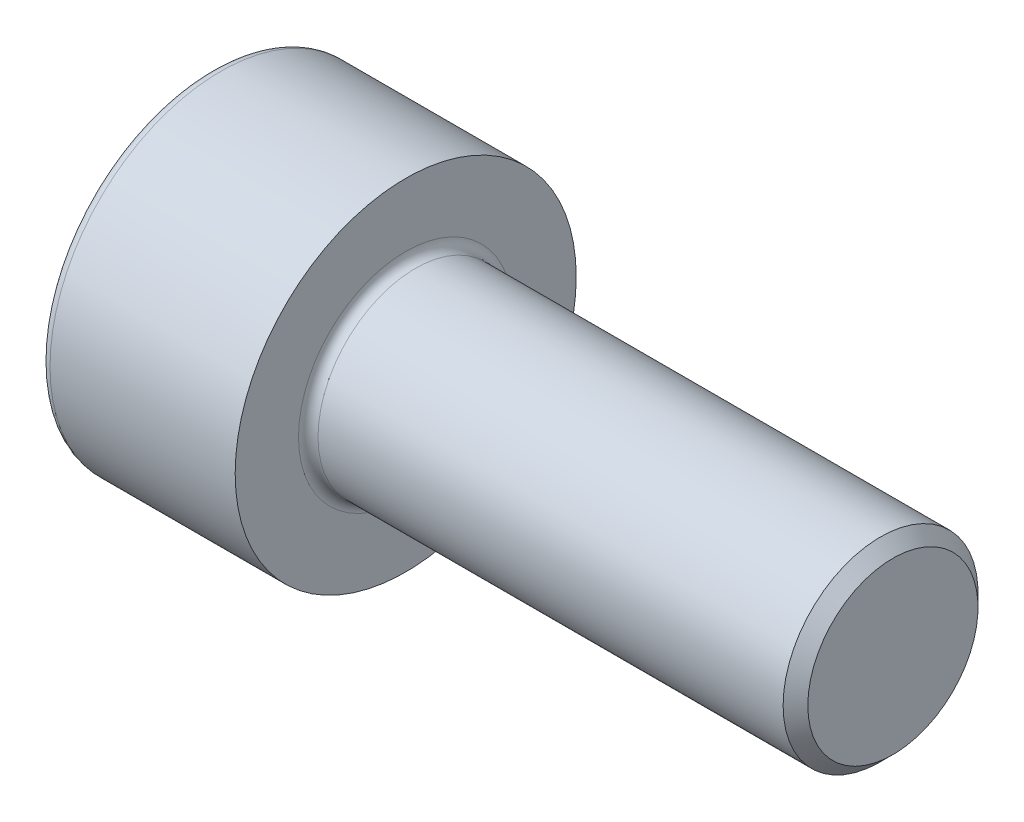
ISO-10303-21;
HEADER;
FILE_DESCRIPTION(('STEP AP214'),'2;1');
FILE_NAME('part.step','',(''),(''),'','','');
FILE_SCHEMA(('AUTOMOTIVE_DESIGN { 1 0 10303 214 1 1 1 1 }'));
ENDSEC;
DATA;
#1=APPLICATION_CONTEXT('core data for automotive mechanical design processes');
#2=APPLICATION_PROTOCOL_DEFINITION('international standard','automotive_design',2000,#1);
#3=PRODUCT_CONTEXT('',#1,'mechanical');
#4=PRODUCT('Part','Part','',(#3));
#5=PRODUCT_RELATED_PRODUCT_CATEGORY('part','',(#4));
#6=PRODUCT_DEFINITION_FORMATION('','',#4);
#7=PRODUCT_DEFINITION_CONTEXT('part definition',#1,'design');
#8=PRODUCT_DEFINITION('design','',#6,#7);
#9=PRODUCT_DEFINITION_SHAPE('','',#8);
#10=(LENGTH_UNIT() NAMED_UNIT(*) SI_UNIT(.MILLI.,.METRE.));
#11=(NAMED_UNIT(*) PLANE_ANGLE_UNIT() SI_UNIT($,.RADIAN.));
#12=(NAMED_UNIT(*) SI_UNIT($,.STERADIAN.) SOLID_ANGLE_UNIT());
#13=UNCERTAINTY_MEASURE_WITH_UNIT(LENGTH_MEASURE(1.E-05),#10,'distance_accuracy_value','');
#14=(GEOMETRIC_REPRESENTATION_CONTEXT(3) GLOBAL_UNCERTAINTY_ASSIGNED_CONTEXT((#13)) GLOBAL_UNIT_ASSIGNED_CONTEXT((#10,
#11,#12)) REPRESENTATION_CONTEXT('',''));
#15=CARTESIAN_POINT('',(0.,0.,0.));
#16=DIRECTION('',(0.,0.,1.));
#17=DIRECTION('',(1.,0.,0.));
#18=AXIS2_PLACEMENT_3D('',#15,#16,#17);
#19=CARTESIAN_POINT('',(10.,0.,0.));
#20=DIRECTION('',(-1.,0.,0.));
#21=DIRECTION('',(0.,0.,1.));
#22=AXIS2_PLACEMENT_3D('',#19,#20,#21);
#23=CONICAL_SURFACE('',#22,1.7464999999935,0.785398163397448);
#24=CARTESIAN_POINT('',(9.7464999999935,0.,0.));
#25=DIRECTION('',(-1.,0.,0.));
#26=DIRECTION('',(0.,0.,1.));
#27=AXIS2_PLACEMENT_3D('',#24,#25,#26);
#28=CIRCLE('',#27,2.);
#29=CARTESIAN_POINT('',(9.7464999999935,0.,2.));
#30=VERTEX_POINT('',#29);
#31=EDGE_CURVE('E11',#30,#30,#28,.T.);
#32=ORIENTED_EDGE('',*,*,#31,.F.);
#33=EDGE_LOOP('',(#32));
#34=FACE_BOUND('',#33,.T.);
#35=CARTESIAN_POINT('',(10.,0.,0.));
#36=DIRECTION('',(-1.,0.,0.));
#37=DIRECTION('',(0.,0.,1.));
#38=AXIS2_PLACEMENT_3D('',#35,#36,#37);
#39=CIRCLE('',#38,1.7464999999935);
#40=CARTESIAN_POINT('',(10.,0.,1.7464999999935));
#41=VERTEX_POINT('',#40);
#42=EDGE_CURVE('E133',#41,#41,#39,.T.);
#43=ORIENTED_EDGE('',*,*,#42,.T.);
#44=EDGE_LOOP('',(#43));
#45=FACE_BOUND('',#44,.T.);
#46=ADVANCED_FACE('F32',(#34,#45),#23,.T.);
#47=CARTESIAN_POINT('',(-4.,0.,0.));
#48=DIRECTION('',(-1.,0.,0.));
#49=DIRECTION('',(0.,0.,1.));
#50=AXIS2_PLACEMENT_3D('',#47,#48,#49);
#51=CYLINDRICAL_SURFACE('',#50,2.);
#52=CARTESIAN_POINT('',(0.200000000000001,0.,0.));
#53=DIRECTION('',(-1.,0.,0.));
#54=DIRECTION('',(0.,0.,1.));
#55=AXIS2_PLACEMENT_3D('',#52,#53,#54);
#56=CIRCLE('',#55,2.);
#57=CARTESIAN_POINT('',(0.200000000000001,0.,2.));
#58=VERTEX_POINT('',#57);
#59=EDGE_CURVE('E39',#58,#58,#56,.T.);
#60=ORIENTED_EDGE('',*,*,#59,.F.);
#61=EDGE_LOOP('',(#60));
#62=FACE_BOUND('',#61,.T.);
#63=ORIENTED_EDGE('',*,*,#31,.T.);
#64=EDGE_LOOP('',(#63));
#65=FACE_BOUND('',#64,.T.);
#66=ADVANCED_FACE('F157',(#62,#65),#51,.T.);
#67=CARTESIAN_POINT('',(0.2,0.,0.));
#68=DIRECTION('',(-1.,0.,0.));
#69=DIRECTION('',(0.,0.,1.));
#70=AXIS2_PLACEMENT_3D('',#67,#68,#69);
#71=TOROIDAL_SURFACE('',#70,2.2,0.2);
#72=CARTESIAN_POINT('',(0.,0.,0.));
#73=DIRECTION('',(-1.,0.,0.));
#74=DIRECTION('',(0.,0.,1.));
#75=AXIS2_PLACEMENT_3D('',#72,#73,#74);
#76=CIRCLE('',#75,2.2);
#77=CARTESIAN_POINT('',(0.,0.,2.2));
#78=VERTEX_POINT('',#77);
#79=EDGE_CURVE('E150',#78,#78,#76,.T.);
#80=ORIENTED_EDGE('',*,*,#79,.F.);
#81=EDGE_LOOP('',(#80));
#82=FACE_BOUND('',#81,.T.);
#83=ORIENTED_EDGE('',*,*,#59,.T.);
#84=EDGE_LOOP('',(#83));
#85=FACE_BOUND('',#84,.T.);
#86=ADVANCED_FACE('F155',(#82,#85),#71,.F.);
#87=CARTESIAN_POINT('',(0.,2.2,0.));
#88=DIRECTION('',(-1.,0.,0.));
#89=DIRECTION('',(0.,0.,1.));
#90=AXIS2_PLACEMENT_3D('',#87,#88,#89);
#91=PLANE('',#90);
#92=CARTESIAN_POINT('',(0.,0.,0.));
#93=DIRECTION('',(-1.,0.,0.));
#94=DIRECTION('',(0.,0.,1.));
#95=AXIS2_PLACEMENT_3D('',#92,#93,#94);
#96=CIRCLE('',#95,3.5);
#97=CARTESIAN_POINT('',(0.,0.,3.5));
#98=VERTEX_POINT('',#97);
#99=EDGE_CURVE('E147',#98,#98,#96,.T.);
#100=ORIENTED_EDGE('',*,*,#99,.F.);
#101=EDGE_LOOP('',(#100));
#102=FACE_BOUND('',#101,.T.);
#103=ORIENTED_EDGE('',*,*,#79,.T.);
#104=EDGE_LOOP('',(#103));
#105=FACE_BOUND('',#104,.T.);
#106=ADVANCED_FACE('F188',(#102,#105),#91,.F.);
#107=CARTESIAN_POINT('',(-4.,0.,0.));
#108=DIRECTION('',(-1.,0.,0.));
#109=DIRECTION('',(0.,0.,1.));
#110=AXIS2_PLACEMENT_3D('',#107,#108,#109);
#111=CYLINDRICAL_SURFACE('',#110,3.5);
#112=CARTESIAN_POINT('',(-3.8,0.,0.));
#113=DIRECTION('',(-1.,0.,0.));
#114=DIRECTION('',(0.,0.,1.));
#115=AXIS2_PLACEMENT_3D('',#112,#113,#114);
#116=CIRCLE('',#115,3.5);
#117=CARTESIAN_POINT('',(-3.8,0.,3.5));
#118=VERTEX_POINT('',#117);
#119=EDGE_CURVE('E144',#118,#118,#116,.T.);
#120=ORIENTED_EDGE('',*,*,#119,.F.);
#121=EDGE_LOOP('',(#120));
#122=FACE_BOUND('',#121,.T.);
#123=ORIENTED_EDGE('',*,*,#99,.T.);
#124=EDGE_LOOP('',(#123));
#125=FACE_BOUND('',#124,.T.);
#126=ADVANCED_FACE('F184',(#122,#125),#111,.T.);
#127=CARTESIAN_POINT('',(-3.8,0.,0.));
#128=DIRECTION('',(-1.,0.,0.));
#129=DIRECTION('',(0.,0.,1.));
#130=AXIS2_PLACEMENT_3D('',#127,#128,#129);
#131=TOROIDAL_SURFACE('',#130,3.3,0.200000000000001);
#132=CARTESIAN_POINT('',(-4.,0.,0.));
#133=DIRECTION('',(-1.,0.,0.));
#134=DIRECTION('',(0.,0.,1.));
#135=AXIS2_PLACEMENT_3D('',#132,#133,#134);
#136=CIRCLE('',#135,3.3);
#137=CARTESIAN_POINT('',(-4.,0.,3.3));
#138=VERTEX_POINT('',#137);
#139=EDGE_CURVE('E141',#138,#138,#136,.T.);
#140=ORIENTED_EDGE('',*,*,#139,.F.);
#141=EDGE_LOOP('',(#140));
#142=FACE_BOUND('',#141,.T.);
#143=ORIENTED_EDGE('',*,*,#119,.T.);
#144=EDGE_LOOP('',(#143));
#145=FACE_BOUND('',#144,.T.);
#146=ADVANCED_FACE('F177',(#142,#145),#131,.T.);
#147=CARTESIAN_POINT('',(-4.,3.3,0.));
#148=DIRECTION('',(1.,0.,0.));
#149=DIRECTION('',(0.,0.,-1.));
#150=AXIS2_PLACEMENT_3D('',#147,#148,#149);
#151=PLANE('',#150);
#152=DIRECTION('',(0.,0.5,-0.866025403784438));
#153=VECTOR('',#152,1.);
#154=CARTESIAN_POINT('',(-4.,0.886232663206076,1.535));
#155=LINE('',#154,#153);
#156=CARTESIAN_POINT('',(-4.,0.886232663206076,1.535));
#157=VERTEX_POINT('',#156);
#158=CARTESIAN_POINT('',(-4.,1.77246532641215,0.));
#159=VERTEX_POINT('',#158);
#160=EDGE_CURVE('E120',#157,#159,#155,.T.);
#161=ORIENTED_EDGE('',*,*,#160,.F.);
#162=DIRECTION('',(0.,1.,0.));
#163=VECTOR('',#162,1.);
#164=CARTESIAN_POINT('',(-4.,-0.886232663206076,1.535));
#165=LINE('',#164,#163);
#166=CARTESIAN_POINT('',(-4.,-0.886232663206076,1.535));
#167=VERTEX_POINT('',#166);
#168=EDGE_CURVE('E46',#167,#157,#165,.T.);
#169=ORIENTED_EDGE('',*,*,#168,.F.);
#170=DIRECTION('',(0.,0.5,0.866025403784439));
#171=VECTOR('',#170,1.);
#172=CARTESIAN_POINT('',(-4.,-1.77246532641215,0.));
#173=LINE('',#172,#171);
#174=CARTESIAN_POINT('',(-4.,-1.77246532641215,0.));
#175=VERTEX_POINT('',#174);
#176=EDGE_CURVE('E129',#175,#167,#173,.T.);
#177=ORIENTED_EDGE('',*,*,#176,.F.);
#178=DIRECTION('',(0.,-0.5,0.866025403784439));
#179=VECTOR('',#178,1.);
#180=CARTESIAN_POINT('',(-4.,-0.886232663206076,-1.535));
#181=LINE('',#180,#179);
#182=CARTESIAN_POINT('',(-4.,-0.886232663206076,-1.535));
#183=VERTEX_POINT('',#182);
#184=EDGE_CURVE('E127',#183,#175,#181,.T.);
#185=ORIENTED_EDGE('',*,*,#184,.F.);
#186=DIRECTION('',(0.,-1.,0.));
#187=VECTOR('',#186,1.);
#188=CARTESIAN_POINT('',(-4.,0.886232663206076,-1.535));
#189=LINE('',#188,#187);
#190=CARTESIAN_POINT('',(-4.,0.886232663206076,-1.535));
#191=VERTEX_POINT('',#190);
#192=EDGE_CURVE('E94',#191,#183,#189,.T.);
#193=ORIENTED_EDGE('',*,*,#192,.F.);
#194=DIRECTION('',(0.,-0.5,-0.866025403784439));
#195=VECTOR('',#194,1.);
#196=CARTESIAN_POINT('',(-4.,1.77246532641215,0.));
#197=LINE('',#196,#195);
#198=EDGE_CURVE('E123',#159,#191,#197,.T.);
#199=ORIENTED_EDGE('',*,*,#198,.F.);
#200=EDGE_LOOP('',(#161,#169,#177,#185,#193,#199));
#201=FACE_BOUND('',#200,.T.);
#202=ORIENTED_EDGE('',*,*,#139,.T.);
#203=EDGE_LOOP('',(#202));
#204=FACE_BOUND('',#203,.T.);
#205=ADVANCED_FACE('F169',(#201,#204),#151,.F.);
#206=CARTESIAN_POINT('',(10.,1.7464999999935,0.));
#207=DIRECTION('',(-1.,0.,0.));
#208=DIRECTION('',(0.,0.,1.));
#209=AXIS2_PLACEMENT_3D('',#206,#207,#208);
#210=PLANE('',#209);
#211=ORIENTED_EDGE('',*,*,#42,.F.);
#212=EDGE_LOOP('',(#211));
#213=FACE_BOUND('',#212,.T.);
#214=ADVANCED_FACE('F166',(#213),#210,.F.);
#215=CARTESIAN_POINT('',(-2.,-0.886232663206076,1.535));
#216=DIRECTION('',(0.,0.,1.));
#217=DIRECTION('',(1.,0.,0.));
#218=AXIS2_PLACEMENT_3D('',#215,#216,#217);
#219=PLANE('',#218);
#220=ORIENTED_EDGE('',*,*,#168,.T.);
#221=DIRECTION('',(-1.,0.,0.));
#222=VECTOR('',#221,1.);
#223=CARTESIAN_POINT('',(-2.,0.886232663206076,1.535));
#224=LINE('',#223,#222);
#225=CARTESIAN_POINT('',(-2.,0.886232663206076,1.535));
#226=VERTEX_POINT('',#225);
#227=EDGE_CURVE('E76',#226,#157,#224,.T.);
#228=ORIENTED_EDGE('',*,*,#227,.F.);
#229=DIRECTION('',(0.,1.,0.));
#230=VECTOR('',#229,1.);
#231=CARTESIAN_POINT('',(-2.,-0.886232663206076,1.535));
#232=LINE('',#231,#230);
#233=CARTESIAN_POINT('',(-2.,-0.886232663206076,1.535));
#234=VERTEX_POINT('',#233);
#235=EDGE_CURVE('E131',#234,#226,#232,.T.);
#236=ORIENTED_EDGE('',*,*,#235,.F.);
#237=DIRECTION('',(-1.,0.,0.));
#238=VECTOR('',#237,1.);
#239=CARTESIAN_POINT('',(-2.,-0.886232663206076,1.535));
#240=LINE('',#239,#238);
#241=EDGE_CURVE('E54',#234,#167,#240,.T.);
#242=ORIENTED_EDGE('',*,*,#241,.T.);
#243=EDGE_LOOP('',(#220,#228,#236,#242));
#244=FACE_BOUND('',#243,.T.);
#245=ADVANCED_FACE('F168',(#244),#219,.F.);
#246=CARTESIAN_POINT('',(-2.,-1.77246532641215,0.));
#247=DIRECTION('',(0.,-0.866025403784439,0.5));
#248=DIRECTION('',(0.,-0.5,-0.866025403784439));
#249=AXIS2_PLACEMENT_3D('',#246,#247,#248);
#250=PLANE('',#249);
#251=ORIENTED_EDGE('',*,*,#176,.T.);
#252=ORIENTED_EDGE('',*,*,#241,.F.);
#253=DIRECTION('',(0.,0.5,0.866025403784439));
#254=VECTOR('',#253,1.);
#255=CARTESIAN_POINT('',(-2.,-1.77246532641215,0.));
#256=LINE('',#255,#254);
#257=CARTESIAN_POINT('',(-2.,-1.77246532641215,0.));
#258=VERTEX_POINT('',#257);
#259=EDGE_CURVE('E106',#258,#234,#256,.T.);
#260=ORIENTED_EDGE('',*,*,#259,.F.);
#261=DIRECTION('',(-1.,0.,0.));
#262=VECTOR('',#261,1.);
#263=CARTESIAN_POINT('',(-2.,-1.77246532641215,0.));
#264=LINE('',#263,#262);
#265=EDGE_CURVE('E98',#258,#175,#264,.T.);
#266=ORIENTED_EDGE('',*,*,#265,.T.);
#267=EDGE_LOOP('',(#251,#252,#260,#266));
#268=FACE_BOUND('',#267,.T.);
#269=ADVANCED_FACE('F175',(#268),#250,.F.);
#270=CARTESIAN_POINT('',(-2.,-0.886232663206076,-1.535));
#271=DIRECTION('',(0.,-0.866025403784439,-0.5));
#272=DIRECTION('',(0.,0.5,-0.866025403784439));
#273=AXIS2_PLACEMENT_3D('',#270,#271,#272);
#274=PLANE('',#273);
#275=ORIENTED_EDGE('',*,*,#184,.T.);
#276=ORIENTED_EDGE('',*,*,#265,.F.);
#277=DIRECTION('',(0.,-0.5,0.866025403784439));
#278=VECTOR('',#277,1.);
#279=CARTESIAN_POINT('',(-2.,-0.886232663206076,-1.535));
#280=LINE('',#279,#278);
#281=CARTESIAN_POINT('',(-2.,-0.886232663206076,-1.535));
#282=VERTEX_POINT('',#281);
#283=EDGE_CURVE('E102',#282,#258,#280,.T.);
#284=ORIENTED_EDGE('',*,*,#283,.F.);
#285=DIRECTION('',(-1.,0.,0.));
#286=VECTOR('',#285,1.);
#287=CARTESIAN_POINT('',(-2.,-0.886232663206076,-1.535));
#288=LINE('',#287,#286);
#289=EDGE_CURVE('E87',#282,#183,#288,.T.);
#290=ORIENTED_EDGE('',*,*,#289,.T.);
#291=EDGE_LOOP('',(#275,#276,#284,#290));
#292=FACE_BOUND('',#291,.T.);
#293=ADVANCED_FACE('F103',(#292),#274,.F.);
#294=CARTESIAN_POINT('',(-2.,0.886232663206076,-1.535));
#295=DIRECTION('',(0.,0.,-1.));
#296=DIRECTION('',(0.,1.,0.));
#297=AXIS2_PLACEMENT_3D('',#294,#295,#296);
#298=PLANE('',#297);
#299=ORIENTED_EDGE('',*,*,#192,.T.);
#300=ORIENTED_EDGE('',*,*,#289,.F.);
#301=DIRECTION('',(0.,-1.,0.));
#302=VECTOR('',#301,1.);
#303=CARTESIAN_POINT('',(-2.,0.886232663206076,-1.535));
#304=LINE('',#303,#302);
#305=CARTESIAN_POINT('',(-2.,0.886232663206076,-1.535));
#306=VERTEX_POINT('',#305);
#307=EDGE_CURVE('E91',#306,#282,#304,.T.);
#308=ORIENTED_EDGE('',*,*,#307,.F.);
#309=DIRECTION('',(-1.,0.,0.));
#310=VECTOR('',#309,1.);
#311=CARTESIAN_POINT('',(-2.,0.886232663206076,-1.535));
#312=LINE('',#311,#310);
#313=EDGE_CURVE('E99',#306,#191,#312,.T.);
#314=ORIENTED_EDGE('',*,*,#313,.T.);
#315=EDGE_LOOP('',(#299,#300,#308,#314));
#316=FACE_BOUND('',#315,.T.);
#317=ADVANCED_FACE('F89',(#316),#298,.F.);
#318=CARTESIAN_POINT('',(-2.,1.77246532641215,0.));
#319=DIRECTION('',(0.,0.866025403784439,-0.5));
#320=DIRECTION('',(0.,0.5,0.866025403784439));
#321=AXIS2_PLACEMENT_3D('',#318,#319,#320);
#322=PLANE('',#321);
#323=ORIENTED_EDGE('',*,*,#198,.T.);
#324=ORIENTED_EDGE('',*,*,#313,.F.);
#325=DIRECTION('',(0.,-0.5,-0.866025403784439));
#326=VECTOR('',#325,1.);
#327=CARTESIAN_POINT('',(-2.,1.77246532641215,0.));
#328=LINE('',#327,#326);
#329=CARTESIAN_POINT('',(-2.,1.77246532641215,0.));
#330=VERTEX_POINT('',#329);
#331=EDGE_CURVE('E112',#330,#306,#328,.T.);
#332=ORIENTED_EDGE('',*,*,#331,.F.);
#333=DIRECTION('',(-1.,0.,0.));
#334=VECTOR('',#333,1.);
#335=CARTESIAN_POINT('',(-2.,1.77246532641215,0.));
#336=LINE('',#335,#334);
#337=EDGE_CURVE('E136',#330,#159,#336,.T.);
#338=ORIENTED_EDGE('',*,*,#337,.T.);
#339=EDGE_LOOP('',(#323,#324,#332,#338));
#340=FACE_BOUND('',#339,.T.);
#341=ADVANCED_FACE('F250',(#340),#322,.F.);
#342=CARTESIAN_POINT('',(-2.,0.886232663206076,1.535));
#343=DIRECTION('',(0.,0.866025403784439,0.5));
#344=DIRECTION('',(0.,-0.5,0.866025403784438));
#345=AXIS2_PLACEMENT_3D('',#342,#343,#344);
#346=PLANE('',#345);
#347=ORIENTED_EDGE('',*,*,#160,.T.);
#348=ORIENTED_EDGE('',*,*,#337,.F.);
#349=DIRECTION('',(0.,0.5,-0.866025403784438));
#350=VECTOR('',#349,1.);
#351=CARTESIAN_POINT('',(-2.,0.886232663206076,1.535));
#352=LINE('',#351,#350);
#353=EDGE_CURVE('E114',#226,#330,#352,.T.);
#354=ORIENTED_EDGE('',*,*,#353,.F.);
#355=ORIENTED_EDGE('',*,*,#227,.T.);
#356=EDGE_LOOP('',(#347,#348,#354,#355));
#357=FACE_BOUND('',#356,.T.);
#358=ADVANCED_FACE('F259',(#357),#346,.F.);
#359=CARTESIAN_POINT('',(-2.,0.,0.));
#360=DIRECTION('',(-1.,0.,0.));
#361=DIRECTION('',(0.,0.,1.));
#362=AXIS2_PLACEMENT_3D('',#359,#360,#361);
#363=PLANE('',#362);
#364=ORIENTED_EDGE('',*,*,#235,.T.);
#365=ORIENTED_EDGE('',*,*,#353,.T.);
#366=ORIENTED_EDGE('',*,*,#331,.T.);
#367=ORIENTED_EDGE('',*,*,#307,.T.);
#368=ORIENTED_EDGE('',*,*,#283,.T.);
#369=ORIENTED_EDGE('',*,*,#259,.T.);
#370=EDGE_LOOP('',(#364,#365,#366,#367,#368,#369));
#371=FACE_BOUND('',#370,.T.);
#372=ADVANCED_FACE('F109',(#371),#363,.T.);
#373=CLOSED_SHELL('',(#46,#66,#86,#106,#126,#146,#205,#214,#245,#269,#293,#317,#341,#358,#372));
#374=MANIFOLD_SOLID_BREP('B2',#373);
#375=ADVANCED_BREP_SHAPE_REPRESENTATION('',(#18,#374),#14);
#376=SHAPE_DEFINITION_REPRESENTATION(#9,#375);
ENDSEC;
END-ISO-10303-21;
